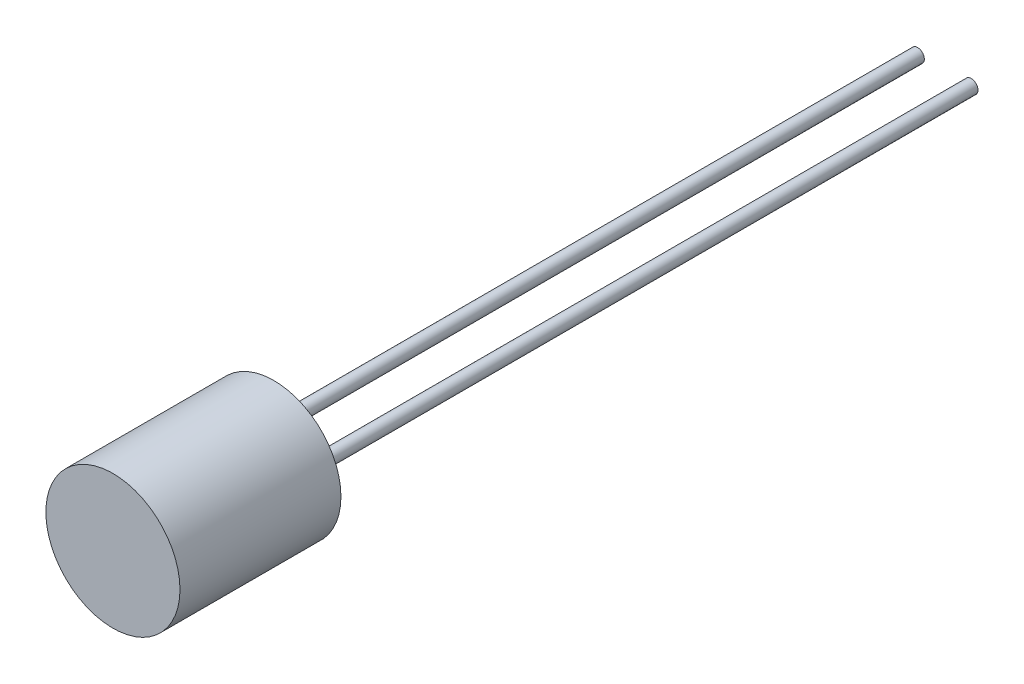
ISO-10303-21;
HEADER;
FILE_DESCRIPTION(('STEP AP214'),'2;1');
FILE_NAME('part.step','',(''),(''),'','','');
FILE_SCHEMA(('AUTOMOTIVE_DESIGN { 1 0 10303 214 1 1 1 1 }'));
ENDSEC;
DATA;
#1=APPLICATION_CONTEXT('core data for automotive mechanical design processes');
#2=APPLICATION_PROTOCOL_DEFINITION('international standard','automotive_design',2000,#1);
#3=PRODUCT_CONTEXT('',#1,'mechanical');
#4=PRODUCT('Part','Part','',(#3));
#5=PRODUCT_RELATED_PRODUCT_CATEGORY('part','',(#4));
#6=PRODUCT_DEFINITION_FORMATION('','',#4);
#7=PRODUCT_DEFINITION_CONTEXT('part definition',#1,'design');
#8=PRODUCT_DEFINITION('design','',#6,#7);
#9=PRODUCT_DEFINITION_SHAPE('','',#8);
#10=(LENGTH_UNIT() NAMED_UNIT(*) SI_UNIT(.MILLI.,.METRE.));
#11=(NAMED_UNIT(*) PLANE_ANGLE_UNIT() SI_UNIT($,.RADIAN.));
#12=(NAMED_UNIT(*) SI_UNIT($,.STERADIAN.) SOLID_ANGLE_UNIT());
#13=UNCERTAINTY_MEASURE_WITH_UNIT(LENGTH_MEASURE(1.E-05),#10,'distance_accuracy_value','');
#14=(GEOMETRIC_REPRESENTATION_CONTEXT(3) GLOBAL_UNCERTAINTY_ASSIGNED_CONTEXT((#13)) GLOBAL_UNIT_ASSIGNED_CONTEXT((#10,
#11,#12)) REPRESENTATION_CONTEXT('',''));
#15=CARTESIAN_POINT('',(0.,0.,0.));
#16=DIRECTION('',(0.,0.,1.));
#17=DIRECTION('',(1.,0.,0.));
#18=AXIS2_PLACEMENT_3D('',#15,#16,#17);
#19=CARTESIAN_POINT('',(0.,0.,6.));
#20=DIRECTION('',(0.,0.,-1.));
#21=DIRECTION('',(-1.,0.,0.));
#22=AXIS2_PLACEMENT_3D('',#19,#20,#21);
#23=CYLINDRICAL_SURFACE('',#22,2.5);
#24=CARTESIAN_POINT('',(0.,0.,6.));
#25=DIRECTION('',(0.,0.,1.));
#26=DIRECTION('',(1.,0.,0.));
#27=AXIS2_PLACEMENT_3D('',#24,#25,#26);
#28=CIRCLE('',#27,2.5);
#29=CARTESIAN_POINT('',(2.5,0.,6.));
#30=VERTEX_POINT('',#29);
#31=EDGE_CURVE('E10',#30,#30,#28,.T.);
#32=ORIENTED_EDGE('',*,*,#31,.F.);
#33=EDGE_LOOP('',(#32));
#34=FACE_BOUND('',#33,.T.);
#35=CARTESIAN_POINT('',(0.,0.,0.));
#36=DIRECTION('',(0.,0.,1.));
#37=DIRECTION('',(1.,0.,0.));
#38=AXIS2_PLACEMENT_3D('',#35,#36,#37);
#39=CIRCLE('',#38,2.5);
#40=CARTESIAN_POINT('',(2.5,0.,0.));
#41=VERTEX_POINT('',#40);
#42=EDGE_CURVE('E35',#41,#41,#39,.T.);
#43=ORIENTED_EDGE('',*,*,#42,.T.);
#44=EDGE_LOOP('',(#43));
#45=FACE_BOUND('',#44,.T.);
#46=ADVANCED_FACE('F32',(#34,#45),#23,.T.);
#47=CARTESIAN_POINT('',(0.,0.,6.));
#48=DIRECTION('',(0.,0.,1.));
#49=DIRECTION('',(1.,0.,0.));
#50=AXIS2_PLACEMENT_3D('',#47,#48,#49);
#51=PLANE('',#50);
#52=ORIENTED_EDGE('',*,*,#31,.T.);
#53=EDGE_LOOP('',(#52));
#54=FACE_BOUND('',#53,.T.);
#55=ADVANCED_FACE('F68',(#54),#51,.T.);
#56=CARTESIAN_POINT('',(0.,0.,0.));
#57=DIRECTION('',(0.,0.,1.));
#58=DIRECTION('',(1.,0.,0.));
#59=AXIS2_PLACEMENT_3D('',#56,#57,#58);
#60=PLANE('',#59);
#61=CARTESIAN_POINT('',(1.,0.,0.));
#62=DIRECTION('',(0.,0.,1.));
#63=DIRECTION('',(1.,0.,0.));
#64=AXIS2_PLACEMENT_3D('',#61,#62,#63);
#65=CIRCLE('',#64,0.25);
#66=CARTESIAN_POINT('',(1.25,0.,0.));
#67=VERTEX_POINT('',#66);
#68=EDGE_CURVE('E50',#67,#67,#65,.T.);
#69=ORIENTED_EDGE('',*,*,#68,.T.);
#70=EDGE_LOOP('',(#69));
#71=FACE_BOUND('',#70,.T.);
#72=CARTESIAN_POINT('',(-1.,0.,0.));
#73=DIRECTION('',(0.,0.,1.));
#74=DIRECTION('',(1.,0.,0.));
#75=AXIS2_PLACEMENT_3D('',#72,#73,#74);
#76=CIRCLE('',#75,0.25);
#77=CARTESIAN_POINT('',(-0.75,0.,0.));
#78=VERTEX_POINT('',#77);
#79=EDGE_CURVE('E44',#78,#78,#76,.T.);
#80=ORIENTED_EDGE('',*,*,#79,.T.);
#81=EDGE_LOOP('',(#80));
#82=FACE_BOUND('',#81,.T.);
#83=ORIENTED_EDGE('',*,*,#42,.F.);
#84=EDGE_LOOP('',(#83));
#85=FACE_BOUND('',#84,.T.);
#86=ADVANCED_FACE('F73',(#71,#82,#85),#60,.F.);
#87=CARTESIAN_POINT('',(-1.,0.,-25.));
#88=DIRECTION('',(0.,0.,1.));
#89=DIRECTION('',(1.,0.,0.));
#90=AXIS2_PLACEMENT_3D('',#87,#88,#89);
#91=CYLINDRICAL_SURFACE('',#90,0.25);
#92=CARTESIAN_POINT('',(-1.,0.,-25.));
#93=DIRECTION('',(0.,0.,1.));
#94=DIRECTION('',(1.,0.,0.));
#95=AXIS2_PLACEMENT_3D('',#92,#93,#94);
#96=CIRCLE('',#95,0.25);
#97=CARTESIAN_POINT('',(-0.75,0.,-25.));
#98=VERTEX_POINT('',#97);
#99=EDGE_CURVE('E42',#98,#98,#96,.T.);
#100=ORIENTED_EDGE('',*,*,#99,.T.);
#101=EDGE_LOOP('',(#100));
#102=FACE_BOUND('',#101,.T.);
#103=ORIENTED_EDGE('',*,*,#79,.F.);
#104=EDGE_LOOP('',(#103));
#105=FACE_BOUND('',#104,.T.);
#106=ADVANCED_FACE('F79',(#102,#105),#91,.T.);
#107=CARTESIAN_POINT('',(-1.,0.,-25.));
#108=DIRECTION('',(0.,0.,1.));
#109=DIRECTION('',(1.,0.,0.));
#110=AXIS2_PLACEMENT_3D('',#107,#108,#109);
#111=PLANE('',#110);
#112=ORIENTED_EDGE('',*,*,#99,.F.);
#113=EDGE_LOOP('',(#112));
#114=FACE_BOUND('',#113,.T.);
#115=ADVANCED_FACE('F65',(#114),#111,.F.);
#116=CARTESIAN_POINT('',(1.,0.,-25.));
#117=DIRECTION('',(0.,0.,1.));
#118=DIRECTION('',(1.,0.,0.));
#119=AXIS2_PLACEMENT_3D('',#116,#117,#118);
#120=CYLINDRICAL_SURFACE('',#119,0.25);
#121=CARTESIAN_POINT('',(1.,0.,-25.));
#122=DIRECTION('',(0.,0.,1.));
#123=DIRECTION('',(1.,0.,0.));
#124=AXIS2_PLACEMENT_3D('',#121,#122,#123);
#125=CIRCLE('',#124,0.25);
#126=CARTESIAN_POINT('',(1.25,0.,-25.));
#127=VERTEX_POINT('',#126);
#128=EDGE_CURVE('E47',#127,#127,#125,.T.);
#129=ORIENTED_EDGE('',*,*,#128,.T.);
#130=EDGE_LOOP('',(#129));
#131=FACE_BOUND('',#130,.T.);
#132=ORIENTED_EDGE('',*,*,#68,.F.);
#133=EDGE_LOOP('',(#132));
#134=FACE_BOUND('',#133,.T.);
#135=ADVANCED_FACE('F56',(#131,#134),#120,.T.);
#136=CARTESIAN_POINT('',(1.,0.,-25.));
#137=DIRECTION('',(0.,0.,1.));
#138=DIRECTION('',(1.,0.,0.));
#139=AXIS2_PLACEMENT_3D('',#136,#137,#138);
#140=PLANE('',#139);
#141=ORIENTED_EDGE('',*,*,#128,.F.);
#142=EDGE_LOOP('',(#141));
#143=FACE_BOUND('',#142,.T.);
#144=ADVANCED_FACE('F59',(#143),#140,.F.);
#145=CLOSED_SHELL('',(#46,#55,#86,#106,#115,#135,#144));
#146=MANIFOLD_SOLID_BREP('B2',#145);
#147=ADVANCED_BREP_SHAPE_REPRESENTATION('',(#18,#146),#14);
#148=SHAPE_DEFINITION_REPRESENTATION(#9,#147);
ENDSEC;
END-ISO-10303-21;
